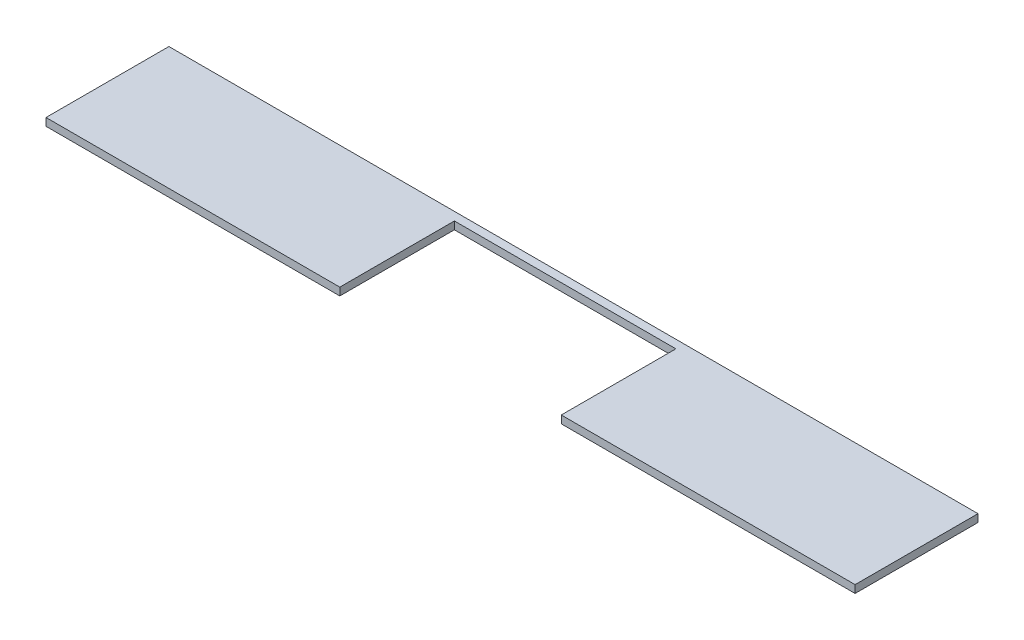
ISO-10303-21;
HEADER;
FILE_DESCRIPTION(('STEP AP214'),'2;1');
FILE_NAME('part.step','',(''),(''),'','','');
FILE_SCHEMA(('AUTOMOTIVE_DESIGN { 1 0 10303 214 1 1 1 1 }'));
ENDSEC;
DATA;
#1=APPLICATION_CONTEXT('core data for automotive mechanical design processes');
#2=APPLICATION_PROTOCOL_DEFINITION('international standard','automotive_design',2000,#1);
#3=PRODUCT_CONTEXT('',#1,'mechanical');
#4=PRODUCT('Part','Part','',(#3));
#5=PRODUCT_RELATED_PRODUCT_CATEGORY('part','',(#4));
#6=PRODUCT_DEFINITION_FORMATION('','',#4);
#7=PRODUCT_DEFINITION_CONTEXT('part definition',#1,'design');
#8=PRODUCT_DEFINITION('design','',#6,#7);
#9=PRODUCT_DEFINITION_SHAPE('','',#8);
#10=(LENGTH_UNIT() NAMED_UNIT(*) SI_UNIT(.MILLI.,.METRE.));
#11=(NAMED_UNIT(*) PLANE_ANGLE_UNIT() SI_UNIT($,.RADIAN.));
#12=(NAMED_UNIT(*) SI_UNIT($,.STERADIAN.) SOLID_ANGLE_UNIT());
#13=UNCERTAINTY_MEASURE_WITH_UNIT(LENGTH_MEASURE(1.E-05),#10,'distance_accuracy_value','');
#14=(GEOMETRIC_REPRESENTATION_CONTEXT(3) GLOBAL_UNCERTAINTY_ASSIGNED_CONTEXT((#13)) GLOBAL_UNIT_ASSIGNED_CONTEXT((#10,
#11,#12)) REPRESENTATION_CONTEXT('',''));
#15=CARTESIAN_POINT('',(0.,0.,0.));
#16=DIRECTION('',(0.,0.,1.));
#17=DIRECTION('',(1.,0.,0.));
#18=AXIS2_PLACEMENT_3D('',#15,#16,#17);
#19=CARTESIAN_POINT('',(158.,3.,24.));
#20=DIRECTION('',(0.,0.,-1.));
#21=DIRECTION('',(-1.,0.,0.));
#22=AXIS2_PLACEMENT_3D('',#19,#20,#21);
#23=PLANE('',#22);
#24=DIRECTION('',(1.,0.,0.));
#25=VECTOR('',#24,1.);
#26=CARTESIAN_POINT('',(158.,0.,24.));
#27=LINE('',#26,#25);
#28=CARTESIAN_POINT('',(-158.,0.,24.));
#29=VERTEX_POINT('',#28);
#30=CARTESIAN_POINT('',(-43.25,0.,24.));
#31=VERTEX_POINT('',#30);
#32=EDGE_CURVE('E150',#29,#31,#27,.T.);
#33=ORIENTED_EDGE('',*,*,#32,.T.);
#34=DIRECTION('',(0.,-1.,0.));
#35=VECTOR('',#34,1.);
#36=CARTESIAN_POINT('',(-43.25,3.,24.));
#37=LINE('',#36,#35);
#38=CARTESIAN_POINT('',(-43.25,3.,24.));
#39=VERTEX_POINT('',#38);
#40=EDGE_CURVE('E136',#39,#31,#37,.T.);
#41=ORIENTED_EDGE('',*,*,#40,.F.);
#42=DIRECTION('',(1.,0.,0.));
#43=VECTOR('',#42,1.);
#44=CARTESIAN_POINT('',(158.,3.,24.));
#45=LINE('',#44,#43);
#46=CARTESIAN_POINT('',(-158.,3.,24.));
#47=VERTEX_POINT('',#46);
#48=EDGE_CURVE('E85',#47,#39,#45,.T.);
#49=ORIENTED_EDGE('',*,*,#48,.F.);
#50=DIRECTION('',(0.,-1.,0.));
#51=VECTOR('',#50,1.);
#52=CARTESIAN_POINT('',(-158.,3.,24.));
#53=LINE('',#52,#51);
#54=EDGE_CURVE('E11',#47,#29,#53,.T.);
#55=ORIENTED_EDGE('',*,*,#54,.T.);
#56=EDGE_LOOP('',(#33,#41,#49,#55));
#57=FACE_BOUND('',#56,.T.);
#58=ADVANCED_FACE('F33',(#57),#23,.F.);
#59=CARTESIAN_POINT('',(-158.,3.,24.));
#60=DIRECTION('',(1.,0.,0.));
#61=DIRECTION('',(0.,0.,-1.));
#62=AXIS2_PLACEMENT_3D('',#59,#60,#61);
#63=PLANE('',#62);
#64=DIRECTION('',(0.,0.,1.));
#65=VECTOR('',#64,1.);
#66=CARTESIAN_POINT('',(-158.,0.,24.));
#67=LINE('',#66,#65);
#68=CARTESIAN_POINT('',(-158.,0.,-24.));
#69=VERTEX_POINT('',#68);
#70=EDGE_CURVE('E135',#69,#29,#67,.T.);
#71=ORIENTED_EDGE('',*,*,#70,.T.);
#72=ORIENTED_EDGE('',*,*,#54,.F.);
#73=DIRECTION('',(0.,0.,1.));
#74=VECTOR('',#73,1.);
#75=CARTESIAN_POINT('',(-158.,3.,24.));
#76=LINE('',#75,#74);
#77=CARTESIAN_POINT('',(-158.,3.,-24.));
#78=VERTEX_POINT('',#77);
#79=EDGE_CURVE('E139',#78,#47,#76,.T.);
#80=ORIENTED_EDGE('',*,*,#79,.F.);
#81=DIRECTION('',(0.,-1.,0.));
#82=VECTOR('',#81,1.);
#83=CARTESIAN_POINT('',(-158.,3.,-24.));
#84=LINE('',#83,#82);
#85=EDGE_CURVE('E146',#78,#69,#84,.T.);
#86=ORIENTED_EDGE('',*,*,#85,.T.);
#87=EDGE_LOOP('',(#71,#72,#80,#86));
#88=FACE_BOUND('',#87,.T.);
#89=ADVANCED_FACE('F35',(#88),#63,.F.);
#90=CARTESIAN_POINT('',(43.25,3.,24.));
#91=VERTEX_POINT('',#90);
#92=CARTESIAN_POINT('',(158.,3.,24.));
#93=VERTEX_POINT('',#92);
#94=EDGE_CURVE('E141',#91,#93,#45,.T.);
#95=ORIENTED_EDGE('',*,*,#94,.F.);
#96=DIRECTION('',(0.,-1.,0.));
#97=VECTOR('',#96,1.);
#98=CARTESIAN_POINT('',(43.25,3.,24.));
#99=LINE('',#98,#97);
#100=CARTESIAN_POINT('',(43.25,0.,24.));
#101=VERTEX_POINT('',#100);
#102=EDGE_CURVE('E114',#91,#101,#99,.T.);
#103=ORIENTED_EDGE('',*,*,#102,.T.);
#104=CARTESIAN_POINT('',(158.,0.,24.));
#105=VERTEX_POINT('',#104);
#106=EDGE_CURVE('E149',#101,#105,#27,.T.);
#107=ORIENTED_EDGE('',*,*,#106,.T.);
#108=DIRECTION('',(0.,-1.,0.));
#109=VECTOR('',#108,1.);
#110=CARTESIAN_POINT('',(158.,3.,24.));
#111=LINE('',#110,#109);
#112=EDGE_CURVE('E41',#93,#105,#111,.T.);
#113=ORIENTED_EDGE('',*,*,#112,.F.);
#114=EDGE_LOOP('',(#95,#103,#107,#113));
#115=FACE_BOUND('',#114,.T.);
#116=ADVANCED_FACE('F182',(#115),#23,.F.);
#117=CARTESIAN_POINT('',(158.,3.,24.));
#118=DIRECTION('',(-1.,0.,0.));
#119=DIRECTION('',(0.,0.,1.));
#120=AXIS2_PLACEMENT_3D('',#117,#118,#119);
#121=PLANE('',#120);
#122=DIRECTION('',(0.,0.,-1.));
#123=VECTOR('',#122,1.);
#124=CARTESIAN_POINT('',(158.,0.,24.));
#125=LINE('',#124,#123);
#126=CARTESIAN_POINT('',(158.,0.,-24.));
#127=VERTEX_POINT('',#126);
#128=EDGE_CURVE('E153',#105,#127,#125,.T.);
#129=ORIENTED_EDGE('',*,*,#128,.T.);
#130=DIRECTION('',(0.,-1.,0.));
#131=VECTOR('',#130,1.);
#132=CARTESIAN_POINT('',(158.,3.,-24.));
#133=LINE('',#132,#131);
#134=CARTESIAN_POINT('',(158.,3.,-24.));
#135=VERTEX_POINT('',#134);
#136=EDGE_CURVE('E157',#135,#127,#133,.T.);
#137=ORIENTED_EDGE('',*,*,#136,.F.);
#138=DIRECTION('',(0.,0.,-1.));
#139=VECTOR('',#138,1.);
#140=CARTESIAN_POINT('',(158.,3.,24.));
#141=LINE('',#140,#139);
#142=EDGE_CURVE('E143',#93,#135,#141,.T.);
#143=ORIENTED_EDGE('',*,*,#142,.F.);
#144=ORIENTED_EDGE('',*,*,#112,.T.);
#145=EDGE_LOOP('',(#129,#137,#143,#144));
#146=FACE_BOUND('',#145,.T.);
#147=ADVANCED_FACE('F163',(#146),#121,.F.);
#148=CARTESIAN_POINT('',(158.,3.,-24.));
#149=DIRECTION('',(0.,0.,1.));
#150=DIRECTION('',(1.,0.,0.));
#151=AXIS2_PLACEMENT_3D('',#148,#149,#150);
#152=PLANE('',#151);
#153=DIRECTION('',(-1.,0.,0.));
#154=VECTOR('',#153,1.);
#155=CARTESIAN_POINT('',(158.,0.,-24.));
#156=LINE('',#155,#154);
#157=EDGE_CURVE('E78',#127,#69,#156,.T.);
#158=ORIENTED_EDGE('',*,*,#157,.T.);
#159=ORIENTED_EDGE('',*,*,#85,.F.);
#160=DIRECTION('',(-1.,0.,0.));
#161=VECTOR('',#160,1.);
#162=CARTESIAN_POINT('',(158.,3.,-24.));
#163=LINE('',#162,#161);
#164=EDGE_CURVE('E57',#135,#78,#163,.T.);
#165=ORIENTED_EDGE('',*,*,#164,.F.);
#166=ORIENTED_EDGE('',*,*,#136,.T.);
#167=EDGE_LOOP('',(#158,#159,#165,#166));
#168=FACE_BOUND('',#167,.T.);
#169=ADVANCED_FACE('F174',(#168),#152,.F.);
#170=CARTESIAN_POINT('',(0.,3.,0.));
#171=DIRECTION('',(0.,1.,0.));
#172=DIRECTION('',(0.,0.,1.));
#173=AXIS2_PLACEMENT_3D('',#170,#171,#172);
#174=PLANE('',#173);
#175=DIRECTION('',(0.,0.,-1.));
#176=VECTOR('',#175,1.);
#177=CARTESIAN_POINT('',(-43.25,3.,24.));
#178=LINE('',#177,#176);
#179=CARTESIAN_POINT('',(-43.25,3.,-20.75));
#180=VERTEX_POINT('',#179);
#181=EDGE_CURVE('E115',#39,#180,#178,.T.);
#182=ORIENTED_EDGE('',*,*,#181,.T.);
#183=DIRECTION('',(1.,0.,0.));
#184=VECTOR('',#183,1.);
#185=CARTESIAN_POINT('',(-43.25,3.,-20.75));
#186=LINE('',#185,#184);
#187=CARTESIAN_POINT('',(43.25,3.,-20.75));
#188=VERTEX_POINT('',#187);
#189=EDGE_CURVE('E110',#180,#188,#186,.T.);
#190=ORIENTED_EDGE('',*,*,#189,.T.);
#191=DIRECTION('',(0.,0.,1.));
#192=VECTOR('',#191,1.);
#193=CARTESIAN_POINT('',(43.25,3.,-20.75));
#194=LINE('',#193,#192);
#195=EDGE_CURVE('E118',#188,#91,#194,.T.);
#196=ORIENTED_EDGE('',*,*,#195,.T.);
#197=ORIENTED_EDGE('',*,*,#94,.T.);
#198=ORIENTED_EDGE('',*,*,#142,.T.);
#199=ORIENTED_EDGE('',*,*,#164,.T.);
#200=ORIENTED_EDGE('',*,*,#79,.T.);
#201=ORIENTED_EDGE('',*,*,#48,.T.);
#202=EDGE_LOOP('',(#182,#190,#196,#197,#198,#199,#200,#201));
#203=FACE_BOUND('',#202,.T.);
#204=ADVANCED_FACE('F123',(#203),#174,.T.);
#205=CARTESIAN_POINT('',(0.,0.,0.));
#206=DIRECTION('',(0.,1.,0.));
#207=DIRECTION('',(0.,0.,1.));
#208=AXIS2_PLACEMENT_3D('',#205,#206,#207);
#209=PLANE('',#208);
#210=DIRECTION('',(1.,0.,0.));
#211=VECTOR('',#210,1.);
#212=CARTESIAN_POINT('',(-43.25,0.,-20.75));
#213=LINE('',#212,#211);
#214=CARTESIAN_POINT('',(-43.25,0.,-20.75));
#215=VERTEX_POINT('',#214);
#216=CARTESIAN_POINT('',(43.25,0.,-20.75));
#217=VERTEX_POINT('',#216);
#218=EDGE_CURVE('E48',#215,#217,#213,.T.);
#219=ORIENTED_EDGE('',*,*,#218,.F.);
#220=DIRECTION('',(0.,0.,-1.));
#221=VECTOR('',#220,1.);
#222=CARTESIAN_POINT('',(-43.25,0.,24.));
#223=LINE('',#222,#221);
#224=EDGE_CURVE('E124',#31,#215,#223,.T.);
#225=ORIENTED_EDGE('',*,*,#224,.F.);
#226=ORIENTED_EDGE('',*,*,#32,.F.);
#227=ORIENTED_EDGE('',*,*,#70,.F.);
#228=ORIENTED_EDGE('',*,*,#157,.F.);
#229=ORIENTED_EDGE('',*,*,#128,.F.);
#230=ORIENTED_EDGE('',*,*,#106,.F.);
#231=DIRECTION('',(0.,0.,1.));
#232=VECTOR('',#231,1.);
#233=CARTESIAN_POINT('',(43.25,0.,-20.75));
#234=LINE('',#233,#232);
#235=EDGE_CURVE('E127',#217,#101,#234,.T.);
#236=ORIENTED_EDGE('',*,*,#235,.F.);
#237=EDGE_LOOP('',(#219,#225,#226,#227,#228,#229,#230,#236));
#238=FACE_BOUND('',#237,.T.);
#239=ADVANCED_FACE('F168',(#238),#209,.F.);
#240=CARTESIAN_POINT('',(-43.25,3.,-20.75));
#241=DIRECTION('',(0.,0.,-1.));
#242=DIRECTION('',(-1.,0.,0.));
#243=AXIS2_PLACEMENT_3D('',#240,#241,#242);
#244=PLANE('',#243);
#245=ORIENTED_EDGE('',*,*,#218,.T.);
#246=DIRECTION('',(0.,-1.,0.));
#247=VECTOR('',#246,1.);
#248=CARTESIAN_POINT('',(43.25,3.,-20.75));
#249=LINE('',#248,#247);
#250=EDGE_CURVE('E106',#188,#217,#249,.T.);
#251=ORIENTED_EDGE('',*,*,#250,.F.);
#252=ORIENTED_EDGE('',*,*,#189,.F.);
#253=DIRECTION('',(0.,-1.,0.));
#254=VECTOR('',#253,1.);
#255=CARTESIAN_POINT('',(-43.25,3.,-20.75));
#256=LINE('',#255,#254);
#257=EDGE_CURVE('E133',#180,#215,#256,.T.);
#258=ORIENTED_EDGE('',*,*,#257,.T.);
#259=EDGE_LOOP('',(#245,#251,#252,#258));
#260=FACE_BOUND('',#259,.T.);
#261=ADVANCED_FACE('F108',(#260),#244,.F.);
#262=CARTESIAN_POINT('',(-43.25,3.,24.));
#263=DIRECTION('',(-1.,0.,0.));
#264=DIRECTION('',(0.,0.,1.));
#265=AXIS2_PLACEMENT_3D('',#262,#263,#264);
#266=PLANE('',#265);
#267=ORIENTED_EDGE('',*,*,#224,.T.);
#268=ORIENTED_EDGE('',*,*,#257,.F.);
#269=ORIENTED_EDGE('',*,*,#181,.F.);
#270=ORIENTED_EDGE('',*,*,#40,.T.);
#271=EDGE_LOOP('',(#267,#268,#269,#270));
#272=FACE_BOUND('',#271,.T.);
#273=ADVANCED_FACE('F224',(#272),#266,.F.);
#274=CARTESIAN_POINT('',(43.25,3.,-20.75));
#275=DIRECTION('',(1.,0.,0.));
#276=DIRECTION('',(0.,0.,-1.));
#277=AXIS2_PLACEMENT_3D('',#274,#275,#276);
#278=PLANE('',#277);
#279=ORIENTED_EDGE('',*,*,#235,.T.);
#280=ORIENTED_EDGE('',*,*,#102,.F.);
#281=ORIENTED_EDGE('',*,*,#195,.F.);
#282=ORIENTED_EDGE('',*,*,#250,.T.);
#283=EDGE_LOOP('',(#279,#280,#281,#282));
#284=FACE_BOUND('',#283,.T.);
#285=ADVANCED_FACE('F119',(#284),#278,.F.);
#286=CLOSED_SHELL('',(#58,#89,#116,#147,#169,#204,#239,#261,#273,#285));
#287=MANIFOLD_SOLID_BREP('B2',#286);
#288=ADVANCED_BREP_SHAPE_REPRESENTATION('',(#18,#287),#14);
#289=SHAPE_DEFINITION_REPRESENTATION(#9,#288);
ENDSEC;
END-ISO-10303-21;
